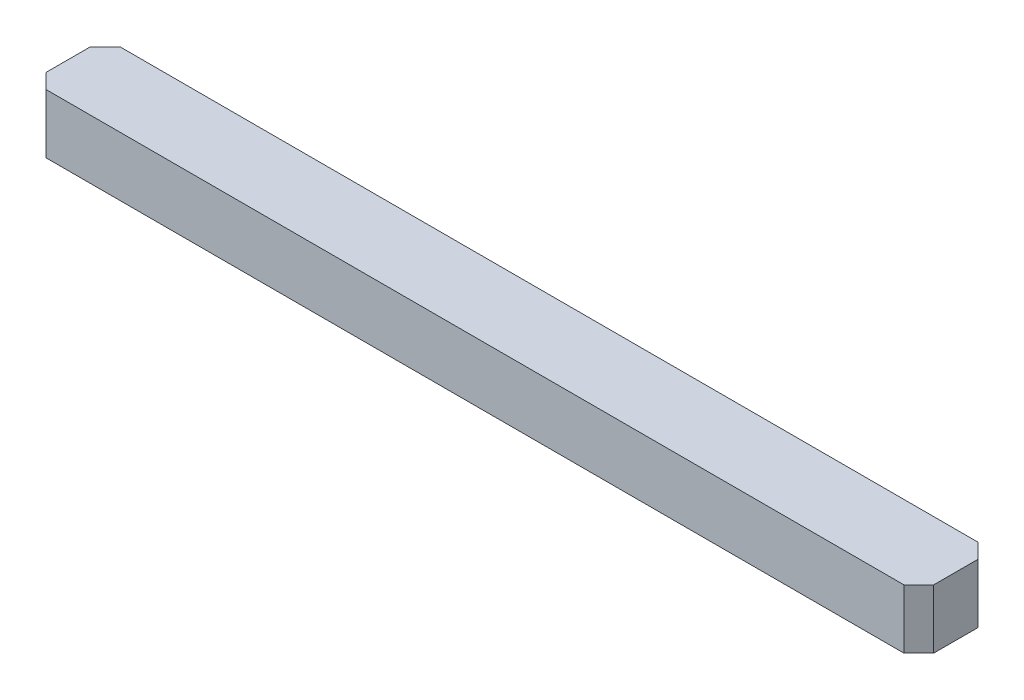
ISO-10303-21;
HEADER;
FILE_DESCRIPTION(('STEP AP214'),'2;1');
FILE_NAME('part.step','',(''),(''),'','','');
FILE_SCHEMA(('AUTOMOTIVE_DESIGN { 1 0 10303 214 1 1 1 1 }'));
ENDSEC;
DATA;
#1=APPLICATION_CONTEXT('core data for automotive mechanical design processes');
#2=APPLICATION_PROTOCOL_DEFINITION('international standard','automotive_design',2000,#1);
#3=PRODUCT_CONTEXT('',#1,'mechanical');
#4=PRODUCT('Part','Part','',(#3));
#5=PRODUCT_RELATED_PRODUCT_CATEGORY('part','',(#4));
#6=PRODUCT_DEFINITION_FORMATION('','',#4);
#7=PRODUCT_DEFINITION_CONTEXT('part definition',#1,'design');
#8=PRODUCT_DEFINITION('design','',#6,#7);
#9=PRODUCT_DEFINITION_SHAPE('','',#8);
#10=(LENGTH_UNIT() NAMED_UNIT(*) SI_UNIT(.MILLI.,.METRE.));
#11=(NAMED_UNIT(*) PLANE_ANGLE_UNIT() SI_UNIT($,.RADIAN.));
#12=(NAMED_UNIT(*) SI_UNIT($,.STERADIAN.) SOLID_ANGLE_UNIT());
#13=UNCERTAINTY_MEASURE_WITH_UNIT(LENGTH_MEASURE(1.E-05),#10,'distance_accuracy_value','');
#14=(GEOMETRIC_REPRESENTATION_CONTEXT(3) GLOBAL_UNCERTAINTY_ASSIGNED_CONTEXT((#13)) GLOBAL_UNIT_ASSIGNED_CONTEXT((#10,
#11,#12)) REPRESENTATION_CONTEXT('',''));
#15=CARTESIAN_POINT('',(0.,0.,0.));
#16=DIRECTION('',(0.,0.,1.));
#17=DIRECTION('',(1.,0.,0.));
#18=AXIS2_PLACEMENT_3D('',#15,#16,#17);
#19=CARTESIAN_POINT('',(0.,4.,0.));
#20=DIRECTION('',(1.,0.,0.));
#21=DIRECTION('',(0.,0.,-1.));
#22=AXIS2_PLACEMENT_3D('',#19,#20,#21);
#23=PLANE('',#22);
#24=DIRECTION('',(0.,0.,1.));
#25=VECTOR('',#24,1.);
#26=CARTESIAN_POINT('',(0.,4.,0.));
#27=LINE('',#26,#25);
#28=CARTESIAN_POINT('',(0.,4.,-4.));
#29=VERTEX_POINT('',#28);
#30=CARTESIAN_POINT('',(0.,4.,-1.00000000000001));
#31=VERTEX_POINT('',#30);
#32=EDGE_CURVE('E129',#29,#31,#27,.T.);
#33=ORIENTED_EDGE('',*,*,#32,.F.);
#34=DIRECTION('',(0.,-1.,0.));
#35=VECTOR('',#34,1.);
#36=CARTESIAN_POINT('',(0.,4.,-4.));
#37=LINE('',#36,#35);
#38=CARTESIAN_POINT('',(0.,0.,-4.));
#39=VERTEX_POINT('',#38);
#40=EDGE_CURVE('E113',#29,#39,#37,.T.);
#41=ORIENTED_EDGE('',*,*,#40,.T.);
#42=DIRECTION('',(0.,0.,1.));
#43=VECTOR('',#42,1.);
#44=CARTESIAN_POINT('',(0.,0.,0.));
#45=LINE('',#44,#43);
#46=CARTESIAN_POINT('',(0.,0.,-1.00000000000001));
#47=VERTEX_POINT('',#46);
#48=EDGE_CURVE('E126',#39,#47,#45,.T.);
#49=ORIENTED_EDGE('',*,*,#48,.T.);
#50=DIRECTION('',(0.,1.,0.));
#51=VECTOR('',#50,1.);
#52=CARTESIAN_POINT('',(0.,4.,-1.00000000000001));
#53=LINE('',#52,#51);
#54=EDGE_CURVE('E132',#47,#31,#53,.T.);
#55=ORIENTED_EDGE('',*,*,#54,.T.);
#56=EDGE_LOOP('',(#33,#41,#49,#55));
#57=FACE_BOUND('',#56,.T.);
#58=ADVANCED_FACE('F41',(#57),#23,.F.);
#59=CARTESIAN_POINT('',(0.,4.,0.));
#60=DIRECTION('',(0.,0.,-1.));
#61=DIRECTION('',(-1.,0.,0.));
#62=AXIS2_PLACEMENT_3D('',#59,#60,#61);
#63=PLANE('',#62);
#64=DIRECTION('',(1.,0.,0.));
#65=VECTOR('',#64,1.);
#66=CARTESIAN_POINT('',(0.,0.,0.));
#67=LINE('',#66,#65);
#68=CARTESIAN_POINT('',(1.00000000000001,0.,0.));
#69=VERTEX_POINT('',#68);
#70=CARTESIAN_POINT('',(59.,0.,0.));
#71=VERTEX_POINT('',#70);
#72=EDGE_CURVE('E137',#69,#71,#67,.T.);
#73=ORIENTED_EDGE('',*,*,#72,.T.);
#74=DIRECTION('',(0.,1.,0.));
#75=VECTOR('',#74,1.);
#76=CARTESIAN_POINT('',(59.,4.,0.));
#77=LINE('',#76,#75);
#78=CARTESIAN_POINT('',(59.,4.,0.));
#79=VERTEX_POINT('',#78);
#80=EDGE_CURVE('E11',#71,#79,#77,.T.);
#81=ORIENTED_EDGE('',*,*,#80,.T.);
#82=DIRECTION('',(1.,0.,0.));
#83=VECTOR('',#82,1.);
#84=CARTESIAN_POINT('',(0.,4.,0.));
#85=LINE('',#84,#83);
#86=CARTESIAN_POINT('',(1.00000000000001,4.,0.));
#87=VERTEX_POINT('',#86);
#88=EDGE_CURVE('E189',#87,#79,#85,.T.);
#89=ORIENTED_EDGE('',*,*,#88,.F.);
#90=DIRECTION('',(0.,-1.,0.));
#91=VECTOR('',#90,1.);
#92=CARTESIAN_POINT('',(1.00000000000001,4.,0.));
#93=LINE('',#92,#91);
#94=EDGE_CURVE('E51',#87,#69,#93,.T.);
#95=ORIENTED_EDGE('',*,*,#94,.T.);
#96=EDGE_LOOP('',(#73,#81,#89,#95));
#97=FACE_BOUND('',#96,.T.);
#98=ADVANCED_FACE('F187',(#97),#63,.F.);
#99=CARTESIAN_POINT('',(60.,4.,0.));
#100=DIRECTION('',(-1.,0.,0.));
#101=DIRECTION('',(0.,0.,1.));
#102=AXIS2_PLACEMENT_3D('',#99,#100,#101);
#103=PLANE('',#102);
#104=DIRECTION('',(0.,0.,-1.));
#105=VECTOR('',#104,1.);
#106=CARTESIAN_POINT('',(60.,0.,0.));
#107=LINE('',#106,#105);
#108=CARTESIAN_POINT('',(60.,0.,-1.00000000000001));
#109=VERTEX_POINT('',#108);
#110=CARTESIAN_POINT('',(60.,0.,-3.99999999999999));
#111=VERTEX_POINT('',#110);
#112=EDGE_CURVE('E141',#109,#111,#107,.T.);
#113=ORIENTED_EDGE('',*,*,#112,.T.);
#114=DIRECTION('',(0.,1.,0.));
#115=VECTOR('',#114,1.);
#116=CARTESIAN_POINT('',(60.,4.,-3.99999999999999));
#117=LINE('',#116,#115);
#118=CARTESIAN_POINT('',(60.,4.,-3.99999999999999));
#119=VERTEX_POINT('',#118);
#120=EDGE_CURVE('E58',#111,#119,#117,.T.);
#121=ORIENTED_EDGE('',*,*,#120,.T.);
#122=DIRECTION('',(0.,0.,-1.));
#123=VECTOR('',#122,1.);
#124=CARTESIAN_POINT('',(60.,4.,0.));
#125=LINE('',#124,#123);
#126=CARTESIAN_POINT('',(60.,4.,-1.00000000000001));
#127=VERTEX_POINT('',#126);
#128=EDGE_CURVE('E197',#127,#119,#125,.T.);
#129=ORIENTED_EDGE('',*,*,#128,.F.);
#130=DIRECTION('',(0.,-1.,0.));
#131=VECTOR('',#130,1.);
#132=CARTESIAN_POINT('',(60.,4.,-1.00000000000001));
#133=LINE('',#132,#131);
#134=EDGE_CURVE('E177',#127,#109,#133,.T.);
#135=ORIENTED_EDGE('',*,*,#134,.T.);
#136=EDGE_LOOP('',(#113,#121,#129,#135));
#137=FACE_BOUND('',#136,.T.);
#138=ADVANCED_FACE('F196',(#137),#103,.F.);
#139=CARTESIAN_POINT('',(0.,4.,-5.));
#140=DIRECTION('',(0.,0.,1.));
#141=DIRECTION('',(1.,0.,0.));
#142=AXIS2_PLACEMENT_3D('',#139,#140,#141);
#143=PLANE('',#142);
#144=DIRECTION('',(-1.,0.,0.));
#145=VECTOR('',#144,1.);
#146=CARTESIAN_POINT('',(0.,0.,-5.));
#147=LINE('',#146,#145);
#148=CARTESIAN_POINT('',(59.,0.,-5.));
#149=VERTEX_POINT('',#148);
#150=CARTESIAN_POINT('',(1.00000000000001,0.,-5.));
#151=VERTEX_POINT('',#150);
#152=EDGE_CURVE('E149',#149,#151,#147,.T.);
#153=ORIENTED_EDGE('',*,*,#152,.T.);
#154=DIRECTION('',(0.,1.,0.));
#155=VECTOR('',#154,1.);
#156=CARTESIAN_POINT('',(1.00000000000001,4.,-5.));
#157=LINE('',#156,#155);
#158=CARTESIAN_POINT('',(1.00000000000001,4.,-5.));
#159=VERTEX_POINT('',#158);
#160=EDGE_CURVE('E114',#151,#159,#157,.T.);
#161=ORIENTED_EDGE('',*,*,#160,.T.);
#162=DIRECTION('',(-1.,0.,0.));
#163=VECTOR('',#162,1.);
#164=CARTESIAN_POINT('',(0.,4.,-5.));
#165=LINE('',#164,#163);
#166=CARTESIAN_POINT('',(59.,4.,-5.));
#167=VERTEX_POINT('',#166);
#168=EDGE_CURVE('E144',#167,#159,#165,.T.);
#169=ORIENTED_EDGE('',*,*,#168,.F.);
#170=DIRECTION('',(0.,-1.,0.));
#171=VECTOR('',#170,1.);
#172=CARTESIAN_POINT('',(59.,4.,-5.));
#173=LINE('',#172,#171);
#174=EDGE_CURVE('E120',#167,#149,#173,.T.);
#175=ORIENTED_EDGE('',*,*,#174,.T.);
#176=EDGE_LOOP('',(#153,#161,#169,#175));
#177=FACE_BOUND('',#176,.T.);
#178=ADVANCED_FACE('F240',(#177),#143,.F.);
#179=CARTESIAN_POINT('',(0.,4.,0.));
#180=DIRECTION('',(0.,-1.,0.));
#181=DIRECTION('',(0.,0.,-1.));
#182=AXIS2_PLACEMENT_3D('',#179,#180,#181);
#183=PLANE('',#182);
#184=ORIENTED_EDGE('',*,*,#168,.T.);
#185=DIRECTION('',(0.70710678118655,0.,-0.707106781186545));
#186=VECTOR('',#185,1.);
#187=CARTESIAN_POINT('',(0.,4.,-4.));
#188=LINE('',#187,#186);
#189=EDGE_CURVE('E174',#159,#29,#188,.F.);
#190=ORIENTED_EDGE('',*,*,#189,.T.);
#191=ORIENTED_EDGE('',*,*,#32,.T.);
#192=DIRECTION('',(-0.707106781186545,0.,-0.70710678118655));
#193=VECTOR('',#192,1.);
#194=CARTESIAN_POINT('',(1.00000000000001,4.,0.));
#195=LINE('',#194,#193);
#196=EDGE_CURVE('E166',#31,#87,#195,.F.);
#197=ORIENTED_EDGE('',*,*,#196,.T.);
#198=ORIENTED_EDGE('',*,*,#88,.T.);
#199=DIRECTION('',(-0.70710678118655,0.,0.707106781186545));
#200=VECTOR('',#199,1.);
#201=CARTESIAN_POINT('',(60.,4.,-1.00000000000001));
#202=LINE('',#201,#200);
#203=EDGE_CURVE('E65',#79,#127,#202,.F.);
#204=ORIENTED_EDGE('',*,*,#203,.T.);
#205=ORIENTED_EDGE('',*,*,#128,.T.);
#206=DIRECTION('',(0.707106781186543,0.,0.707106781186552));
#207=VECTOR('',#206,1.);
#208=CARTESIAN_POINT('',(59.,4.,-5.));
#209=LINE('',#208,#207);
#210=EDGE_CURVE('E171',#119,#167,#209,.F.);
#211=ORIENTED_EDGE('',*,*,#210,.T.);
#212=EDGE_LOOP('',(#184,#190,#191,#197,#198,#204,#205,#211));
#213=FACE_BOUND('',#212,.T.);
#214=ADVANCED_FACE('F206',(#213),#183,.F.);
#215=CARTESIAN_POINT('',(0.,0.,0.));
#216=DIRECTION('',(0.,-1.,0.));
#217=DIRECTION('',(0.,0.,-1.));
#218=AXIS2_PLACEMENT_3D('',#215,#216,#217);
#219=PLANE('',#218);
#220=ORIENTED_EDGE('',*,*,#48,.F.);
#221=DIRECTION('',(-0.70710678118655,0.,0.707106781186545));
#222=VECTOR('',#221,1.);
#223=CARTESIAN_POINT('',(-2.,0.,-2.00000000000001));
#224=LINE('',#223,#222);
#225=EDGE_CURVE('E109',#39,#151,#224,.F.);
#226=ORIENTED_EDGE('',*,*,#225,.T.);
#227=ORIENTED_EDGE('',*,*,#152,.F.);
#228=DIRECTION('',(-0.707106781186543,0.,-0.707106781186552));
#229=VECTOR('',#228,1.);
#230=CARTESIAN_POINT('',(32.0000000000004,0.,-32.));
#231=LINE('',#230,#229);
#232=EDGE_CURVE('E121',#149,#111,#231,.F.);
#233=ORIENTED_EDGE('',*,*,#232,.T.);
#234=ORIENTED_EDGE('',*,*,#112,.F.);
#235=DIRECTION('',(0.70710678118655,0.,-0.707106781186545));
#236=VECTOR('',#235,1.);
#237=CARTESIAN_POINT('',(29.4999999999998,0.,29.5));
#238=LINE('',#237,#236);
#239=EDGE_CURVE('E156',#109,#71,#238,.F.);
#240=ORIENTED_EDGE('',*,*,#239,.T.);
#241=ORIENTED_EDGE('',*,*,#72,.F.);
#242=DIRECTION('',(0.707106781186545,0.,0.70710678118655));
#243=VECTOR('',#242,1.);
#244=CARTESIAN_POINT('',(0.500000000000007,0.,-0.500000000000004));
#245=LINE('',#244,#243);
#246=EDGE_CURVE('E131',#69,#47,#245,.F.);
#247=ORIENTED_EDGE('',*,*,#246,.T.);
#248=EDGE_LOOP('',(#220,#226,#227,#233,#234,#240,#241,#247));
#249=FACE_BOUND('',#248,.T.);
#250=ADVANCED_FACE('F134',(#249),#219,.T.);
#251=CARTESIAN_POINT('',(0.,4.,-4.));
#252=DIRECTION('',(0.707106781186545,0.,0.70710678118655));
#253=DIRECTION('',(0.,-1.,0.));
#254=AXIS2_PLACEMENT_3D('',#251,#252,#253);
#255=PLANE('',#254);
#256=ORIENTED_EDGE('',*,*,#189,.F.);
#257=ORIENTED_EDGE('',*,*,#160,.F.);
#258=ORIENTED_EDGE('',*,*,#225,.F.);
#259=ORIENTED_EDGE('',*,*,#40,.F.);
#260=EDGE_LOOP('',(#256,#257,#258,#259));
#261=FACE_BOUND('',#260,.T.);
#262=ADVANCED_FACE('F112',(#261),#255,.F.);
#263=CARTESIAN_POINT('',(59.,4.,-5.));
#264=DIRECTION('',(-0.707106781186552,0.,0.707106781186542));
#265=DIRECTION('',(0.,-1.,0.));
#266=AXIS2_PLACEMENT_3D('',#263,#264,#265);
#267=PLANE('',#266);
#268=ORIENTED_EDGE('',*,*,#210,.F.);
#269=ORIENTED_EDGE('',*,*,#120,.F.);
#270=ORIENTED_EDGE('',*,*,#232,.F.);
#271=ORIENTED_EDGE('',*,*,#174,.F.);
#272=EDGE_LOOP('',(#268,#269,#270,#271));
#273=FACE_BOUND('',#272,.T.);
#274=ADVANCED_FACE('F211',(#273),#267,.F.);
#275=CARTESIAN_POINT('',(60.,4.,-1.00000000000001));
#276=DIRECTION('',(-0.707106781186545,0.,-0.70710678118655));
#277=DIRECTION('',(0.,-1.,0.));
#278=AXIS2_PLACEMENT_3D('',#275,#276,#277);
#279=PLANE('',#278);
#280=ORIENTED_EDGE('',*,*,#203,.F.);
#281=ORIENTED_EDGE('',*,*,#80,.F.);
#282=ORIENTED_EDGE('',*,*,#239,.F.);
#283=ORIENTED_EDGE('',*,*,#134,.F.);
#284=EDGE_LOOP('',(#280,#281,#282,#283));
#285=FACE_BOUND('',#284,.T.);
#286=ADVANCED_FACE('F195',(#285),#279,.F.);
#287=CARTESIAN_POINT('',(1.00000000000001,4.,0.));
#288=DIRECTION('',(0.70710678118655,0.,-0.707106781186545));
#289=DIRECTION('',(0.,-1.,0.));
#290=AXIS2_PLACEMENT_3D('',#287,#288,#289);
#291=PLANE('',#290);
#292=ORIENTED_EDGE('',*,*,#196,.F.);
#293=ORIENTED_EDGE('',*,*,#54,.F.);
#294=ORIENTED_EDGE('',*,*,#246,.F.);
#295=ORIENTED_EDGE('',*,*,#94,.F.);
#296=EDGE_LOOP('',(#292,#293,#294,#295));
#297=FACE_BOUND('',#296,.T.);
#298=ADVANCED_FACE('F44',(#297),#291,.F.);
#299=CLOSED_SHELL('',(#58,#98,#138,#178,#214,#250,#262,#274,#286,#298));
#300=MANIFOLD_SOLID_BREP('B2',#299);
#301=ADVANCED_BREP_SHAPE_REPRESENTATION('',(#18,#300),#14);
#302=SHAPE_DEFINITION_REPRESENTATION(#9,#301);
ENDSEC;
END-ISO-10303-21;
